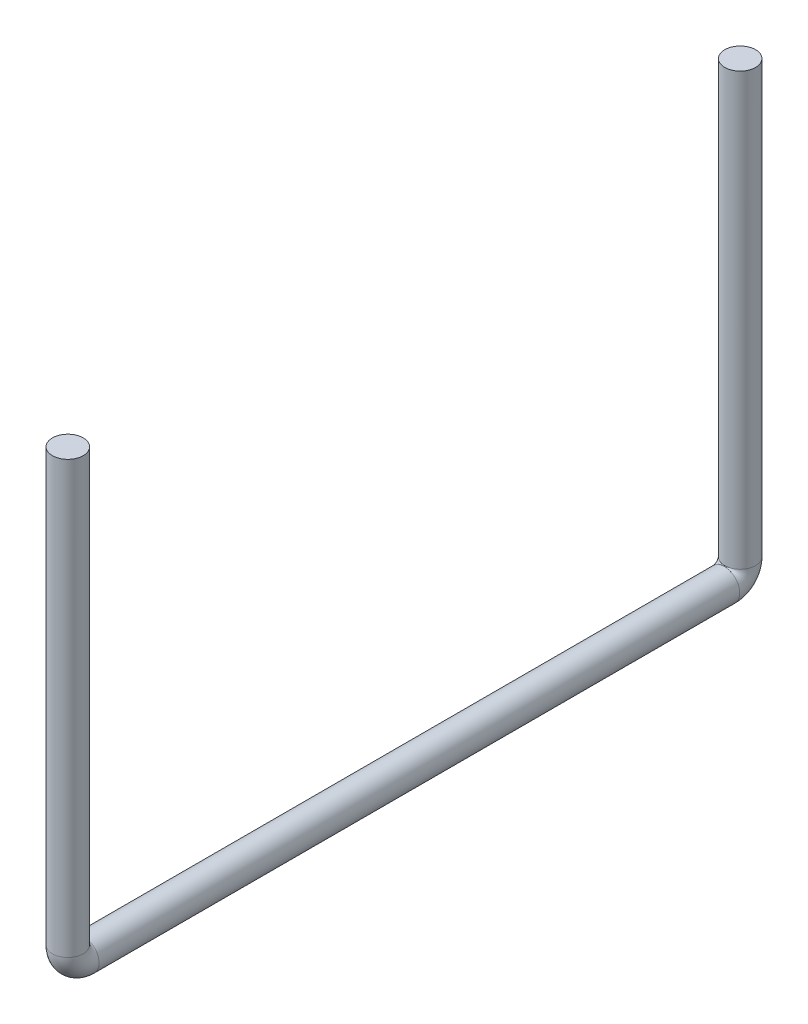
ISO-10303-21;
HEADER;
FILE_DESCRIPTION(('STEP AP214'),'2;1');
FILE_NAME('part.step','',(''),(''),'','','');
FILE_SCHEMA(('AUTOMOTIVE_DESIGN { 1 0 10303 214 1 1 1 1 }'));
ENDSEC;
DATA;
#1=APPLICATION_CONTEXT('core data for automotive mechanical design processes');
#2=APPLICATION_PROTOCOL_DEFINITION('international standard','automotive_design',2000,#1);
#3=PRODUCT_CONTEXT('',#1,'mechanical');
#4=PRODUCT('Part','Part','',(#3));
#5=PRODUCT_RELATED_PRODUCT_CATEGORY('part','',(#4));
#6=PRODUCT_DEFINITION_FORMATION('','',#4);
#7=PRODUCT_DEFINITION_CONTEXT('part definition',#1,'design');
#8=PRODUCT_DEFINITION('design','',#6,#7);
#9=PRODUCT_DEFINITION_SHAPE('','',#8);
#10=(LENGTH_UNIT() NAMED_UNIT(*) SI_UNIT(.MILLI.,.METRE.));
#11=(NAMED_UNIT(*) PLANE_ANGLE_UNIT() SI_UNIT($,.RADIAN.));
#12=(NAMED_UNIT(*) SI_UNIT($,.STERADIAN.) SOLID_ANGLE_UNIT());
#13=UNCERTAINTY_MEASURE_WITH_UNIT(LENGTH_MEASURE(1.E-05),#10,'distance_accuracy_value','');
#14=(GEOMETRIC_REPRESENTATION_CONTEXT(3) GLOBAL_UNCERTAINTY_ASSIGNED_CONTEXT((#13)) GLOBAL_UNIT_ASSIGNED_CONTEXT((#10,
#11,#12)) REPRESENTATION_CONTEXT('',''));
#15=CARTESIAN_POINT('',(0.,0.,0.));
#16=DIRECTION('',(0.,0.,1.));
#17=DIRECTION('',(1.,0.,0.));
#18=AXIS2_PLACEMENT_3D('',#15,#16,#17);
#19=CARTESIAN_POINT('',(0.,13.0757754901936,528.066));
#20=DIRECTION('',(-1.,0.,0.));
#21=DIRECTION('',(0.,0.,-1.));
#22=AXIS2_PLACEMENT_3D('',#19,#20,#21);
#23=TOROIDAL_SURFACE('',#22,13.0757754901936,12.7);
#24=CARTESIAN_POINT('',(0.,0.,528.066));
#25=DIRECTION('',(0.,0.,1.));
#26=DIRECTION('',(1.,0.,0.));
#27=AXIS2_PLACEMENT_3D('',#24,#25,#26);
#28=CIRCLE('',#27,12.7);
#29=CARTESIAN_POINT('',(0.,-12.7,528.066));
#30=VERTEX_POINT('',#29);
#31=EDGE_CURVE('E11',#30,#30,#28,.T.);
#32=CARTESIAN_POINT('',(0.,13.0757754901936,541.141775490193));
#33=DIRECTION('',(0.,-1.,0.));
#34=DIRECTION('',(0.,0.,-1.));
#35=AXIS2_PLACEMENT_3D('',#32,#33,#34);
#36=CIRCLE('',#35,12.7);
#37=CARTESIAN_POINT('',(0.,13.0757754901937,553.841775490194));
#38=VERTEX_POINT('',#37);
#39=EDGE_CURVE('E51',#38,#38,#36,.T.);
#40=CARTESIAN_POINT('',(0.,13.0757754901936,528.066));
#41=DIRECTION('',(-1.,0.,0.));
#42=DIRECTION('',(0.,0.,-1.));
#43=AXIS2_PLACEMENT_3D('',#40,#41,#42);
#44=CIRCLE('',#43,25.7757754901936);
#45=EDGE_CURVE('',#30,#38,#44,.T.);
#46=ORIENTED_EDGE('',*,*,#31,.T.);
#47=ORIENTED_EDGE('',*,*,#39,.T.);
#48=ORIENTED_EDGE('',*,*,#45,.T.);
#49=ORIENTED_EDGE('',*,*,#45,.F.);
#50=EDGE_LOOP('',(#46,#48,#47,#49));
#51=FACE_BOUND('',#50,.T.);
#52=ADVANCED_FACE('F41',(#51),#23,.T.);
#53=CARTESIAN_POINT('',(0.,0.,528.066));
#54=DIRECTION('',(0.,0.,-1.));
#55=DIRECTION('',(1.,0.,0.));
#56=AXIS2_PLACEMENT_3D('',#53,#54,#55);
#57=PLANE('',#56);
#58=ORIENTED_EDGE('',*,*,#31,.F.);
#59=EDGE_LOOP('',(#58));
#60=FACE_BOUND('',#59,.T.);
#61=ADVANCED_FACE('F62',(#60),#57,.T.);
#62=CARTESIAN_POINT('',(0.,368.675775490194,541.141775490192));
#63=DIRECTION('',(0.,-1.,0.));
#64=DIRECTION('',(0.,0.,1.));
#65=AXIS2_PLACEMENT_3D('',#62,#63,#64);
#66=CYLINDRICAL_SURFACE('',#65,12.7);
#67=CARTESIAN_POINT('',(0.,368.675775490194,541.141775490192));
#68=DIRECTION('',(0.,-1.,0.));
#69=DIRECTION('',(0.,0.,-1.));
#70=AXIS2_PLACEMENT_3D('',#67,#68,#69);
#71=CIRCLE('',#70,12.7);
#72=CARTESIAN_POINT('',(0.,368.675775490194,528.441775490192));
#73=VERTEX_POINT('',#72);
#74=EDGE_CURVE('E47',#73,#73,#71,.T.);
#75=ORIENTED_EDGE('',*,*,#74,.T.);
#76=EDGE_LOOP('',(#75));
#77=FACE_BOUND('',#76,.T.);
#78=ORIENTED_EDGE('',*,*,#39,.F.);
#79=EDGE_LOOP('',(#78));
#80=FACE_BOUND('',#79,.T.);
#81=ADVANCED_FACE('F59',(#77,#80),#66,.T.);
#82=CARTESIAN_POINT('',(0.,368.675775490194,541.141775490192));
#83=DIRECTION('',(0.,1.,0.));
#84=DIRECTION('',(0.,0.,-1.));
#85=AXIS2_PLACEMENT_3D('',#82,#83,#84);
#86=PLANE('',#85);
#87=ORIENTED_EDGE('',*,*,#74,.F.);
#88=EDGE_LOOP('',(#87));
#89=FACE_BOUND('',#88,.T.);
#90=ADVANCED_FACE('F61',(#89),#86,.T.);
#91=CLOSED_SHELL('',(#52,#61,#81,#90));
#92=MANIFOLD_SOLID_BREP('B2',#91);
#93=CARTESIAN_POINT('',(0.,13.0757754901936,0.));
#94=DIRECTION('',(-1.,0.,0.));
#95=DIRECTION('',(0.,0.,1.));
#96=AXIS2_PLACEMENT_3D('',#93,#94,#95);
#97=TOROIDAL_SURFACE('',#96,13.0757754901936,12.7);
#98=CARTESIAN_POINT('',(0.,13.0757754901936,-13.0757754901936));
#99=DIRECTION('',(0.,1.,0.));
#100=DIRECTION('',(0.,0.,1.));
#101=AXIS2_PLACEMENT_3D('',#98,#99,#100);
#102=CIRCLE('',#101,12.7);
#103=CARTESIAN_POINT('',(0.,13.0757754901937,-25.7757754901936));
#104=VERTEX_POINT('',#103);
#105=EDGE_CURVE('E132',#104,#104,#102,.T.);
#106=CARTESIAN_POINT('',(0.,0.,0.));
#107=DIRECTION('',(0.,0.,1.));
#108=DIRECTION('',(1.,0.,0.));
#109=AXIS2_PLACEMENT_3D('',#106,#107,#108);
#110=CIRCLE('',#109,12.7);
#111=CARTESIAN_POINT('',(0.,-12.7,0.));
#112=VERTEX_POINT('',#111);
#113=EDGE_CURVE('E40',#112,#112,#110,.T.);
#114=CARTESIAN_POINT('',(0.,13.0757754901936,0.));
#115=DIRECTION('',(-1.,0.,0.));
#116=DIRECTION('',(0.,0.,1.));
#117=AXIS2_PLACEMENT_3D('',#114,#115,#116);
#118=CIRCLE('',#117,25.7757754901936);
#119=EDGE_CURVE('',#104,#112,#118,.T.);
#120=ORIENTED_EDGE('',*,*,#105,.F.);
#121=ORIENTED_EDGE('',*,*,#113,.F.);
#122=ORIENTED_EDGE('',*,*,#119,.T.);
#123=ORIENTED_EDGE('',*,*,#119,.F.);
#124=EDGE_LOOP('',(#120,#122,#121,#123));
#125=FACE_BOUND('',#124,.T.);
#126=ADVANCED_FACE('F122',(#125),#97,.T.);
#127=CARTESIAN_POINT('',(0.,0.,0.));
#128=DIRECTION('',(0.,0.,1.));
#129=DIRECTION('',(1.,0.,0.));
#130=AXIS2_PLACEMENT_3D('',#127,#128,#129);
#131=PLANE('',#130);
#132=ORIENTED_EDGE('',*,*,#113,.T.);
#133=EDGE_LOOP('',(#132));
#134=FACE_BOUND('',#133,.T.);
#135=ADVANCED_FACE('F143',(#134),#131,.T.);
#136=CARTESIAN_POINT('',(0.,368.675775490194,-13.0757754901923));
#137=DIRECTION('',(0.,-1.,0.));
#138=DIRECTION('',(0.,0.,-1.));
#139=AXIS2_PLACEMENT_3D('',#136,#137,#138);
#140=CYLINDRICAL_SURFACE('',#139,12.7);
#141=CARTESIAN_POINT('',(0.,368.675775490194,-13.0757754901923));
#142=DIRECTION('',(0.,1.,0.));
#143=DIRECTION('',(0.,0.,1.));
#144=AXIS2_PLACEMENT_3D('',#141,#142,#143);
#145=CIRCLE('',#144,12.7);
#146=CARTESIAN_POINT('',(0.,368.675775490194,-0.375775490192336));
#147=VERTEX_POINT('',#146);
#148=EDGE_CURVE('E128',#147,#147,#145,.T.);
#149=ORIENTED_EDGE('',*,*,#148,.F.);
#150=EDGE_LOOP('',(#149));
#151=FACE_BOUND('',#150,.T.);
#152=ORIENTED_EDGE('',*,*,#105,.T.);
#153=EDGE_LOOP('',(#152));
#154=FACE_BOUND('',#153,.T.);
#155=ADVANCED_FACE('F139',(#151,#154),#140,.T.);
#156=CARTESIAN_POINT('',(0.,368.675775490194,-13.0757754901923));
#157=DIRECTION('',(0.,1.,0.));
#158=DIRECTION('',(0.,0.,1.));
#159=AXIS2_PLACEMENT_3D('',#156,#157,#158);
#160=PLANE('',#159);
#161=ORIENTED_EDGE('',*,*,#148,.T.);
#162=EDGE_LOOP('',(#161));
#163=FACE_BOUND('',#162,.T.);
#164=ADVANCED_FACE('F150',(#163),#160,.T.);
#165=CLOSED_SHELL('',(#126,#135,#155,#164));
#166=MANIFOLD_SOLID_BREP('B6',#165);
#167=CARTESIAN_POINT('',(0.,0.,528.066));
#168=DIRECTION('',(0.,0.,-1.));
#169=DIRECTION('',(-1.,0.,0.));
#170=AXIS2_PLACEMENT_3D('',#167,#168,#169);
#171=CYLINDRICAL_SURFACE('',#170,12.7);
#172=CARTESIAN_POINT('',(0.,0.,528.066));
#173=DIRECTION('',(0.,0.,1.));
#174=DIRECTION('',(1.,0.,0.));
#175=AXIS2_PLACEMENT_3D('',#172,#173,#174);
#176=CIRCLE('',#175,12.7);
#177=CARTESIAN_POINT('',(12.7,0.,528.066));
#178=VERTEX_POINT('',#177);
#179=EDGE_CURVE('E121',#178,#178,#176,.T.);
#180=ORIENTED_EDGE('',*,*,#179,.F.);
#181=EDGE_LOOP('',(#180));
#182=FACE_BOUND('',#181,.T.);
#183=CARTESIAN_POINT('',(0.,0.,0.));
#184=DIRECTION('',(0.,0.,1.));
#185=DIRECTION('',(1.,0.,0.));
#186=AXIS2_PLACEMENT_3D('',#183,#184,#185);
#187=CIRCLE('',#186,12.7);
#188=CARTESIAN_POINT('',(12.7,0.,0.));
#189=VERTEX_POINT('',#188);
#190=EDGE_CURVE('E188',#189,#189,#187,.T.);
#191=ORIENTED_EDGE('',*,*,#190,.T.);
#192=EDGE_LOOP('',(#191));
#193=FACE_BOUND('',#192,.T.);
#194=ADVANCED_FACE('F185',(#182,#193),#171,.T.);
#195=CARTESIAN_POINT('',(0.,0.,528.066));
#196=DIRECTION('',(0.,0.,1.));
#197=DIRECTION('',(1.,0.,0.));
#198=AXIS2_PLACEMENT_3D('',#195,#196,#197);
#199=PLANE('',#198);
#200=ORIENTED_EDGE('',*,*,#179,.T.);
#201=EDGE_LOOP('',(#200));
#202=FACE_BOUND('',#201,.T.);
#203=ADVANCED_FACE('F200',(#202),#199,.T.);
#204=CARTESIAN_POINT('',(0.,0.,0.));
#205=DIRECTION('',(0.,0.,1.));
#206=DIRECTION('',(1.,0.,0.));
#207=AXIS2_PLACEMENT_3D('',#204,#205,#206);
#208=PLANE('',#207);
#209=ORIENTED_EDGE('',*,*,#190,.F.);
#210=EDGE_LOOP('',(#209));
#211=FACE_BOUND('',#210,.T.);
#212=ADVANCED_FACE('F198',(#211),#208,.F.);
#213=CLOSED_SHELL('',(#194,#203,#212));
#214=MANIFOLD_SOLID_BREP('B35',#213);
#215=ADVANCED_BREP_SHAPE_REPRESENTATION('',(#18,#92,#166,#214),#14);
#216=SHAPE_DEFINITION_REPRESENTATION(#9,#215);
ENDSEC;
END-ISO-10303-21;
